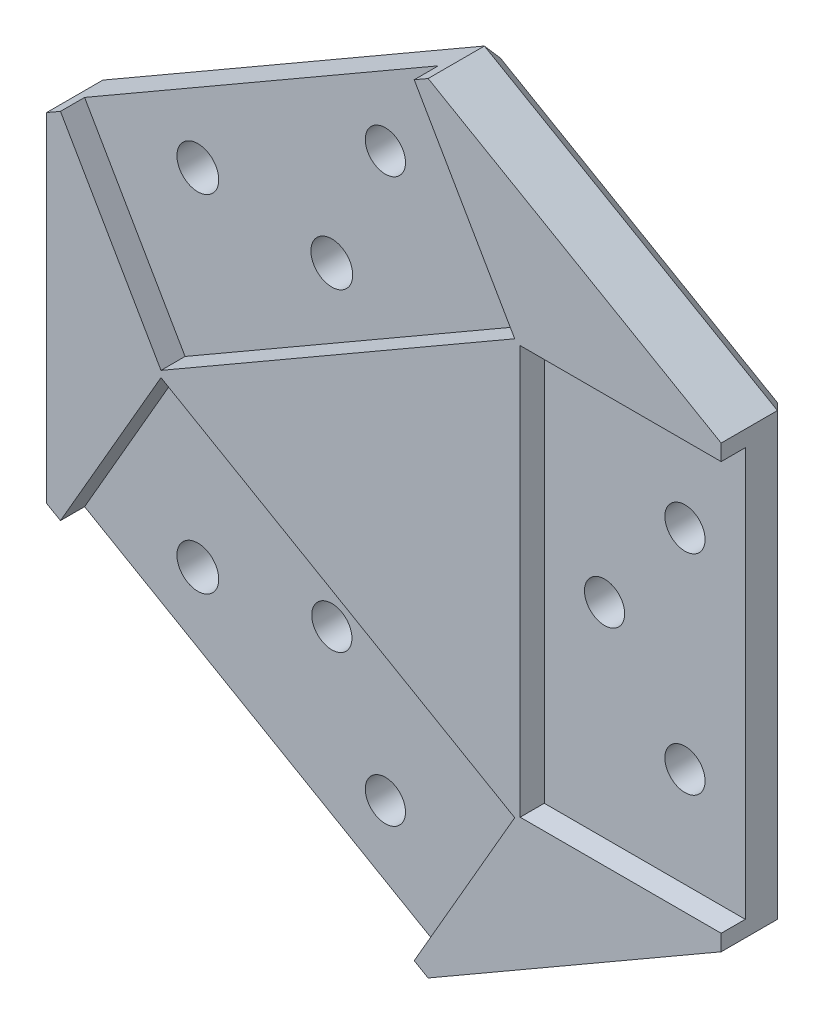
ISO-10303-21;
HEADER;
FILE_DESCRIPTION(('STEP AP214'),'2;1');
FILE_NAME('part.step','',(''),(''),'','','');
FILE_SCHEMA(('AUTOMOTIVE_DESIGN { 1 0 10303 214 1 1 1 1 }'));
ENDSEC;
DATA;
#1=APPLICATION_CONTEXT('core data for automotive mechanical design processes');
#2=APPLICATION_PROTOCOL_DEFINITION('international standard','automotive_design',2000,#1);
#3=PRODUCT_CONTEXT('',#1,'mechanical');
#4=PRODUCT('Part','Part','',(#3));
#5=PRODUCT_RELATED_PRODUCT_CATEGORY('part','',(#4));
#6=PRODUCT_DEFINITION_FORMATION('','',#4);
#7=PRODUCT_DEFINITION_CONTEXT('part definition',#1,'design');
#8=PRODUCT_DEFINITION('design','',#6,#7);
#9=PRODUCT_DEFINITION_SHAPE('','',#8);
#10=(LENGTH_UNIT() NAMED_UNIT(*) SI_UNIT(.MILLI.,.METRE.));
#11=(NAMED_UNIT(*) PLANE_ANGLE_UNIT() SI_UNIT($,.RADIAN.));
#12=(NAMED_UNIT(*) SI_UNIT($,.STERADIAN.) SOLID_ANGLE_UNIT());
#13=UNCERTAINTY_MEASURE_WITH_UNIT(LENGTH_MEASURE(1.E-05),#10,'distance_accuracy_value','');
#14=(GEOMETRIC_REPRESENTATION_CONTEXT(3) GLOBAL_UNCERTAINTY_ASSIGNED_CONTEXT((#13)) GLOBAL_UNIT_ASSIGNED_CONTEXT((#10,
#11,#12)) REPRESENTATION_CONTEXT('',''));
#15=CARTESIAN_POINT('',(0.,0.,0.));
#16=DIRECTION('',(0.,0.,1.));
#17=DIRECTION('',(1.,0.,0.));
#18=AXIS2_PLACEMENT_3D('',#15,#16,#17);
#19=CARTESIAN_POINT('',(2956.50955933893,1134.24136903722,6.));
#20=DIRECTION('',(0.,0.,1.));
#21=DIRECTION('',(1.,0.,0.));
#22=AXIS2_PLACEMENT_3D('',#19,#20,#21);
#23=PLANE('',#22);
#24=CARTESIAN_POINT('',(2953.69965040785,1269.05044132499,6.));
#25=DIRECTION('',(0.,0.,1.));
#26=DIRECTION('',(1.,0.,0.));
#27=AXIS2_PLACEMENT_3D('',#24,#25,#26);
#28=CIRCLE('',#27,2.49999999999995);
#29=CARTESIAN_POINT('',(2956.19965040785,1269.05044132499,6.));
#30=VERTEX_POINT('',#29);
#31=EDGE_CURVE('E473',#30,#30,#28,.T.);
#32=ORIENTED_EDGE('',*,*,#31,.F.);
#33=EDGE_LOOP('',(#32));
#34=FACE_BOUND('',#33,.T.);
#35=CARTESIAN_POINT('',(2930.37469953259,1255.58377465832,6.));
#36=DIRECTION('',(0.,0.,1.));
#37=DIRECTION('',(1.,0.,0.));
#38=AXIS2_PLACEMENT_3D('',#35,#36,#37);
#39=CIRCLE('',#38,2.60000000000016);
#40=CARTESIAN_POINT('',(2932.97469953259,1255.58377465832,6.));
#41=VERTEX_POINT('',#40);
#42=EDGE_CURVE('E476',#41,#41,#39,.T.);
#43=ORIENTED_EDGE('',*,*,#42,.F.);
#44=EDGE_LOOP('',(#43));
#45=FACE_BOUND('',#44,.T.);
#46=CARTESIAN_POINT('',(2947.03717497023,1253.65685395381,6.));
#47=DIRECTION('',(0.,0.,1.));
#48=DIRECTION('',(1.,0.,0.));
#49=AXIS2_PLACEMENT_3D('',#46,#47,#48);
#50=CIRCLE('',#49,2.60000000000016);
#51=CARTESIAN_POINT('',(2949.63717497023,1253.65685395381,6.));
#52=VERTEX_POINT('',#51);
#53=EDGE_CURVE('E479',#52,#52,#50,.T.);
#54=ORIENTED_EDGE('',*,*,#53,.F.);
#55=EDGE_LOOP('',(#54));
#56=FACE_BOUND('',#55,.T.);
#57=DIRECTION('',(0.866025403784455,0.499999999999972,0.));
#58=VECTOR('',#57,1.);
#59=CARTESIAN_POINT('',(2893.68304147526,1243.06009003974,6.));
#60=LINE('',#59,#58);
#61=CARTESIAN_POINT('',(2916.2901297141,1256.11229852003,6.));
#62=VERTEX_POINT('',#61);
#63=CARTESIAN_POINT('',(2960.28422022636,1281.51229852003,6.));
#64=VERTEX_POINT('',#63);
#65=EDGE_CURVE('E344',#62,#64,#60,.T.);
#66=ORIENTED_EDGE('',*,*,#65,.F.);
#67=DIRECTION('',(0.499999999999984,-0.866025403784448,0.));
#68=VECTOR('',#67,1.);
#69=CARTESIAN_POINT('',(2979.11664757778,1147.29357751751,6.));
#70=LINE('',#69,#68);
#71=CARTESIAN_POINT('',(2928.7901297141,1234.46166342542,6.));
#72=VERTEX_POINT('',#71);
#73=EDGE_CURVE('E383',#62,#72,#70,.T.);
#74=ORIENTED_EDGE('',*,*,#73,.T.);
#75=DIRECTION('',(0.866025403784332,0.500000000000184,0.));
#76=VECTOR('',#75,1.);
#77=CARTESIAN_POINT('',(2906.18304147524,1221.40945494511,6.));
#78=LINE('',#77,#76);
#79=CARTESIAN_POINT('',(2972.78422022635,1259.86166342543,6.));
#80=VERTEX_POINT('',#79);
#81=EDGE_CURVE('E376',#72,#80,#78,.T.);
#82=ORIENTED_EDGE('',*,*,#81,.T.);
#83=DIRECTION('',(0.499999999999986,-0.866025403784447,0.));
#84=VECTOR('',#83,1.);
#85=CARTESIAN_POINT('',(3023.11073809003,1172.69357751751,6.));
#86=LINE('',#85,#84);
#87=EDGE_CURVE('E361',#64,#80,#86,.T.);
#88=ORIENTED_EDGE('',*,*,#87,.F.);
#89=EDGE_LOOP('',(#66,#74,#82,#88));
#90=FACE_BOUND('',#89,.T.);
#91=ADVANCED_FACE('F35',(#34,#45,#56,#90),#23,.T.);
#92=CARTESIAN_POINT('',(2990.96103977133,1221.07090147894,6.));
#93=DIRECTION('',(0.,0.,1.));
#94=DIRECTION('',(1.,0.,0.));
#95=AXIS2_PLACEMENT_3D('',#92,#93,#94);
#96=CIRCLE('',#95,2.49999999999995);
#97=CARTESIAN_POINT('',(2993.46103977133,1221.07090147894,6.));
#98=VERTEX_POINT('',#97);
#99=EDGE_CURVE('E438',#98,#98,#96,.T.);
#100=ORIENTED_EDGE('',*,*,#99,.F.);
#101=EDGE_LOOP('',(#100));
#102=FACE_BOUND('',#101,.T.);
#103=CARTESIAN_POINT('',(2980.96103977133,1234.07090147894,6.));
#104=DIRECTION('',(0.,0.,1.));
#105=DIRECTION('',(1.,0.,0.));
#106=AXIS2_PLACEMENT_3D('',#103,#104,#105);
#107=CIRCLE('',#106,2.49999999999995);
#108=CARTESIAN_POINT('',(2983.46103977133,1234.07090147894,6.));
#109=VERTEX_POINT('',#108);
#110=EDGE_CURVE('E440',#109,#109,#107,.T.);
#111=ORIENTED_EDGE('',*,*,#110,.F.);
#112=EDGE_LOOP('',(#111));
#113=FACE_BOUND('',#112,.T.);
#114=CARTESIAN_POINT('',(2990.96103977133,1247.07090147894,6.));
#115=DIRECTION('',(0.,0.,1.));
#116=DIRECTION('',(1.,0.,0.));
#117=AXIS2_PLACEMENT_3D('',#114,#115,#116);
#118=CIRCLE('',#117,2.49999999999995);
#119=CARTESIAN_POINT('',(2993.46103977133,1247.07090147894,6.));
#120=VERTEX_POINT('',#119);
#121=EDGE_CURVE('E470',#120,#120,#118,.T.);
#122=ORIENTED_EDGE('',*,*,#121,.F.);
#123=EDGE_LOOP('',(#122));
#124=FACE_BOUND('',#123,.T.);
#125=DIRECTION('',(-1.48612530855335E-13,-1.,0.));
#126=VECTOR('',#125,1.);
#127=CARTESIAN_POINT('',(2973.46103977131,1134.24136903722,6.));
#128=LINE('',#127,#126);
#129=CARTESIAN_POINT('',(2973.46103977133,1259.47090147894,6.));
#130=VERTEX_POINT('',#129);
#131=CARTESIAN_POINT('',(2973.46103977132,1208.67090147894,6.));
#132=VERTEX_POINT('',#131);
#133=EDGE_CURVE('E242',#130,#132,#128,.T.);
#134=ORIENTED_EDGE('',*,*,#133,.T.);
#135=DIRECTION('',(1.,0.,0.));
#136=VECTOR('',#135,1.);
#137=CARTESIAN_POINT('',(2956.50955933893,1208.67090147894,6.));
#138=LINE('',#137,#136);
#139=CARTESIAN_POINT('',(2998.46103977133,1208.67090147894,6.));
#140=VERTEX_POINT('',#139);
#141=EDGE_CURVE('E184',#132,#140,#138,.T.);
#142=ORIENTED_EDGE('',*,*,#141,.T.);
#143=DIRECTION('',(0.,-1.,0.));
#144=VECTOR('',#143,1.);
#145=CARTESIAN_POINT('',(2998.46103977133,1134.24136903722,6.));
#146=LINE('',#145,#144);
#147=CARTESIAN_POINT('',(2998.46103977133,1259.47090147894,6.));
#148=VERTEX_POINT('',#147);
#149=EDGE_CURVE('E340',#148,#140,#146,.T.);
#150=ORIENTED_EDGE('',*,*,#149,.F.);
#151=DIRECTION('',(1.,1.15463194561027E-13,0.));
#152=VECTOR('',#151,1.);
#153=CARTESIAN_POINT('',(2956.50955933891,1259.47090147894,6.));
#154=LINE('',#153,#152);
#155=EDGE_CURVE('E359',#130,#148,#154,.T.);
#156=ORIENTED_EDGE('',*,*,#155,.F.);
#157=EDGE_LOOP('',(#134,#142,#150,#156));
#158=FACE_BOUND('',#157,.T.);
#159=ADVANCED_FACE('F406',(#102,#113,#124,#158),#23,.T.);
#160=CARTESIAN_POINT('',(2998.46103977133,1134.24136903722,6.));
#161=DIRECTION('',(1.,0.,0.));
#162=DIRECTION('',(0.,1.,0.));
#163=AXIS2_PLACEMENT_3D('',#160,#161,#162);
#164=PLANE('',#163);
#165=DIRECTION('',(0.,0.,-1.));
#166=VECTOR('',#165,1.);
#167=CARTESIAN_POINT('',(2998.46103977133,1206.67090147895,6.));
#168=LINE('',#167,#166);
#169=CARTESIAN_POINT('',(2998.46103977133,1206.67090147895,9.));
#170=VERTEX_POINT('',#169);
#171=CARTESIAN_POINT('',(2998.46103977133,1206.67090147895,2.00000000000006));
#172=VERTEX_POINT('',#171);
#173=EDGE_CURVE('E335',#170,#172,#168,.T.);
#174=ORIENTED_EDGE('',*,*,#173,.T.);
#175=DIRECTION('',(0.,1.,0.));
#176=VECTOR('',#175,1.);
#177=CARTESIAN_POINT('',(2998.46103977133,1261.47090147895,2.00000000000006));
#178=LINE('',#177,#176);
#179=CARTESIAN_POINT('',(2998.46103977133,1261.47090147895,2.00000000000006));
#180=VERTEX_POINT('',#179);
#181=EDGE_CURVE('E44',#172,#180,#178,.T.);
#182=ORIENTED_EDGE('',*,*,#181,.T.);
#183=DIRECTION('',(0.,0.,-1.));
#184=VECTOR('',#183,1.);
#185=CARTESIAN_POINT('',(2998.46103977133,1261.47090147895,6.));
#186=LINE('',#185,#184);
#187=CARTESIAN_POINT('',(2998.46103977133,1261.47090147895,9.));
#188=VERTEX_POINT('',#187);
#189=EDGE_CURVE('E252',#188,#180,#186,.T.);
#190=ORIENTED_EDGE('',*,*,#189,.F.);
#191=DIRECTION('',(0.,1.,0.));
#192=VECTOR('',#191,1.);
#193=CARTESIAN_POINT('',(2998.46103977133,1134.24136903722,9.));
#194=LINE('',#193,#192);
#195=CARTESIAN_POINT('',(2998.46103977133,1259.47090147894,9.));
#196=VERTEX_POINT('',#195);
#197=EDGE_CURVE('E206',#196,#188,#194,.T.);
#198=ORIENTED_EDGE('',*,*,#197,.F.);
#199=DIRECTION('',(0.,0.,-1.));
#200=VECTOR('',#199,1.);
#201=CARTESIAN_POINT('',(2998.46103977133,1259.47090147894,9.));
#202=LINE('',#201,#200);
#203=EDGE_CURVE('E364',#196,#148,#202,.T.);
#204=ORIENTED_EDGE('',*,*,#203,.T.);
#205=ORIENTED_EDGE('',*,*,#149,.T.);
#206=DIRECTION('',(0.,0.,-1.));
#207=VECTOR('',#206,1.);
#208=CARTESIAN_POINT('',(2998.46103977133,1208.67090147894,9.));
#209=LINE('',#208,#207);
#210=CARTESIAN_POINT('',(2998.46103977133,1208.67090147894,9.));
#211=VERTEX_POINT('',#210);
#212=EDGE_CURVE('E402',#211,#140,#209,.T.);
#213=ORIENTED_EDGE('',*,*,#212,.F.);
#214=EDGE_CURVE('E198',#170,#211,#194,.T.);
#215=ORIENTED_EDGE('',*,*,#214,.F.);
#216=EDGE_LOOP('',(#174,#182,#190,#198,#204,#205,#213,#215));
#217=FACE_BOUND('',#216,.T.);
#218=ADVANCED_FACE('F408',(#217),#164,.T.);
#219=CARTESIAN_POINT('',(3022.08943305008,1247.82904225895,6.));
#220=DIRECTION('',(0.499999999999793,0.866025403784558,0.));
#221=DIRECTION('',(-0.866025403784558,0.499999999999794,0.));
#222=AXIS2_PLACEMENT_3D('',#219,#220,#221);
#223=PLANE('',#222);
#224=ORIENTED_EDGE('',*,*,#189,.T.);
#225=DIRECTION('',(-0.866025403784558,0.499999999999794,0.));
#226=VECTOR('',#225,1.);
#227=CARTESIAN_POINT('',(2962.01627103393,1282.51229852003,2.00000000000005));
#228=LINE('',#227,#226);
#229=CARTESIAN_POINT('',(2962.01627103393,1282.51229852003,2.00000000000006));
#230=VERTEX_POINT('',#229);
#231=EDGE_CURVE('E11',#180,#230,#228,.T.);
#232=ORIENTED_EDGE('',*,*,#231,.T.);
#233=DIRECTION('',(0.,0.,-1.));
#234=VECTOR('',#233,1.);
#235=CARTESIAN_POINT('',(2962.01627103393,1282.51229852003,6.));
#236=LINE('',#235,#234);
#237=CARTESIAN_POINT('',(2962.01627103393,1282.51229852003,9.));
#238=VERTEX_POINT('',#237);
#239=EDGE_CURVE('E306',#238,#230,#236,.T.);
#240=ORIENTED_EDGE('',*,*,#239,.F.);
#241=DIRECTION('',(-0.866025403784558,0.499999999999794,0.));
#242=VECTOR('',#241,1.);
#243=CARTESIAN_POINT('',(3022.08943305008,1247.82904225895,9.));
#244=LINE('',#243,#242);
#245=EDGE_CURVE('E211',#188,#238,#244,.T.);
#246=ORIENTED_EDGE('',*,*,#245,.F.);
#247=EDGE_LOOP('',(#224,#232,#240,#246));
#248=FACE_BOUND('',#247,.T.);
#249=ADVANCED_FACE('F304',(#248),#223,.T.);
#250=CARTESIAN_POINT('',(2893.68304147526,1243.06009003974,6.));
#251=DIRECTION('',(-0.499999999999972,0.866025403784455,0.));
#252=DIRECTION('',(-0.866025403784455,-0.499999999999972,0.));
#253=AXIS2_PLACEMENT_3D('',#250,#251,#252);
#254=PLANE('',#253);
#255=ORIENTED_EDGE('',*,*,#239,.T.);
#256=DIRECTION('',(-0.866025403784455,-0.499999999999972,0.));
#257=VECTOR('',#256,1.);
#258=CARTESIAN_POINT('',(2914.55807890654,1255.11229852003,2.00000000000006));
#259=LINE('',#258,#257);
#260=CARTESIAN_POINT('',(2914.55807890654,1255.11229852003,2.00000000000006));
#261=VERTEX_POINT('',#260);
#262=EDGE_CURVE('E263',#230,#261,#259,.T.);
#263=ORIENTED_EDGE('',*,*,#262,.T.);
#264=DIRECTION('',(0.,0.,-1.));
#265=VECTOR('',#264,1.);
#266=CARTESIAN_POINT('',(2914.55807890654,1255.11229852003,6.));
#267=LINE('',#266,#265);
#268=CARTESIAN_POINT('',(2914.55807890654,1255.11229852003,9.));
#269=VERTEX_POINT('',#268);
#270=EDGE_CURVE('E313',#269,#261,#267,.T.);
#271=ORIENTED_EDGE('',*,*,#270,.F.);
#272=DIRECTION('',(-0.866025403784455,-0.499999999999972,0.));
#273=VECTOR('',#272,1.);
#274=CARTESIAN_POINT('',(2893.68304147526,1243.06009003974,9.));
#275=LINE('',#274,#273);
#276=CARTESIAN_POINT('',(2916.2901297141,1256.11229852003,9.));
#277=VERTEX_POINT('',#276);
#278=EDGE_CURVE('E217',#277,#269,#275,.T.);
#279=ORIENTED_EDGE('',*,*,#278,.F.);
#280=DIRECTION('',(0.,0.,-1.));
#281=VECTOR('',#280,1.);
#282=CARTESIAN_POINT('',(2916.2901297141,1256.11229852003,9.));
#283=LINE('',#282,#281);
#284=EDGE_CURVE('E377',#277,#62,#283,.T.);
#285=ORIENTED_EDGE('',*,*,#284,.T.);
#286=ORIENTED_EDGE('',*,*,#65,.T.);
#287=DIRECTION('',(0.,0.,-1.));
#288=VECTOR('',#287,1.);
#289=CARTESIAN_POINT('',(2960.28422022636,1281.51229852003,9.));
#290=LINE('',#289,#288);
#291=CARTESIAN_POINT('',(2960.28422022636,1281.51229852003,9.));
#292=VERTEX_POINT('',#291);
#293=EDGE_CURVE('E367',#292,#64,#290,.T.);
#294=ORIENTED_EDGE('',*,*,#293,.F.);
#295=EDGE_CURVE('E214',#238,#292,#275,.T.);
#296=ORIENTED_EDGE('',*,*,#295,.F.);
#297=EDGE_LOOP('',(#255,#263,#271,#279,#285,#286,#294,#296));
#298=FACE_BOUND('',#297,.T.);
#299=ADVANCED_FACE('F310',(#298),#254,.T.);
#300=CARTESIAN_POINT('',(2914.5580789065,1134.24136903723,6.));
#301=DIRECTION('',(1.,-2.63818752732291E-13,0.));
#302=DIRECTION('',(2.63818752732291E-13,1.,0.));
#303=AXIS2_PLACEMENT_3D('',#300,#301,#302);
#304=PLANE('',#303);
#305=ORIENTED_EDGE('',*,*,#270,.T.);
#306=DIRECTION('',(-2.63818752732291E-13,-1.,0.));
#307=VECTOR('',#306,1.);
#308=CARTESIAN_POINT('',(2914.5580789065,1134.24136903723,2.00000000000006));
#309=LINE('',#308,#307);
#310=CARTESIAN_POINT('',(2914.55807890653,1213.02950443785,2.00000000000006));
#311=VERTEX_POINT('',#310);
#312=EDGE_CURVE('E266',#261,#311,#309,.T.);
#313=ORIENTED_EDGE('',*,*,#312,.T.);
#314=DIRECTION('',(0.,0.,-1.));
#315=VECTOR('',#314,1.);
#316=CARTESIAN_POINT('',(2914.55807890653,1213.02950443785,6.));
#317=LINE('',#316,#315);
#318=CARTESIAN_POINT('',(2914.55807890653,1213.02950443785,9.));
#319=VERTEX_POINT('',#318);
#320=EDGE_CURVE('E327',#319,#311,#317,.T.);
#321=ORIENTED_EDGE('',*,*,#320,.F.);
#322=DIRECTION('',(-2.63818752732291E-13,-1.,0.));
#323=VECTOR('',#322,1.);
#324=CARTESIAN_POINT('',(2914.5580789065,1134.24136903723,9.));
#325=LINE('',#324,#323);
#326=EDGE_CURVE('E225',#269,#319,#325,.T.);
#327=ORIENTED_EDGE('',*,*,#326,.F.);
#328=EDGE_LOOP('',(#305,#313,#321,#327));
#329=FACE_BOUND('',#328,.T.);
#330=ADVANCED_FACE('F325',(#329),#304,.F.);
#331=CARTESIAN_POINT('',(2980.13795261771,1175.16694669724,6.));
#332=DIRECTION('',(0.500000000000381,0.866025403784218,0.));
#333=DIRECTION('',(-0.866025403784219,0.500000000000381,0.));
#334=AXIS2_PLACEMENT_3D('',#331,#332,#333);
#335=PLANE('',#334);
#336=ORIENTED_EDGE('',*,*,#320,.T.);
#337=DIRECTION('',(0.866025403784219,-0.500000000000381,0.));
#338=VECTOR('',#337,1.);
#339=CARTESIAN_POINT('',(2980.13795261771,1175.16694669724,2.00000000000005));
#340=LINE('',#339,#338);
#341=CARTESIAN_POINT('',(2962.01627103391,1185.62950443782,2.00000000000006));
#342=VERTEX_POINT('',#341);
#343=EDGE_CURVE('E268',#311,#342,#340,.T.);
#344=ORIENTED_EDGE('',*,*,#343,.T.);
#345=DIRECTION('',(0.,0.,-1.));
#346=VECTOR('',#345,1.);
#347=CARTESIAN_POINT('',(2962.01627103391,1185.62950443782,6.));
#348=LINE('',#347,#346);
#349=CARTESIAN_POINT('',(2962.01627103391,1185.62950443782,9.));
#350=VERTEX_POINT('',#349);
#351=EDGE_CURVE('E332',#350,#342,#348,.T.);
#352=ORIENTED_EDGE('',*,*,#351,.F.);
#353=DIRECTION('',(0.866025403784219,-0.500000000000381,0.));
#354=VECTOR('',#353,1.);
#355=CARTESIAN_POINT('',(2980.13795261771,1175.16694669724,9.));
#356=LINE('',#355,#354);
#357=CARTESIAN_POINT('',(2960.28422022633,1186.62950443783,9.));
#358=VERTEX_POINT('',#357);
#359=EDGE_CURVE('E231',#358,#350,#356,.T.);
#360=ORIENTED_EDGE('',*,*,#359,.F.);
#361=DIRECTION('',(0.,0.,-1.));
#362=VECTOR('',#361,1.);
#363=CARTESIAN_POINT('',(2960.28422022633,1186.62950443783,9.));
#364=LINE('',#363,#362);
#365=CARTESIAN_POINT('',(2960.28422022633,1186.62950443783,6.));
#366=VERTEX_POINT('',#365);
#367=EDGE_CURVE('E398',#358,#366,#364,.T.);
#368=ORIENTED_EDGE('',*,*,#367,.T.);
#369=DIRECTION('',(0.866025403784219,-0.500000000000381,0.));
#370=VECTOR('',#369,1.);
#371=CARTESIAN_POINT('',(2980.13795261771,1175.16694669724,6.));
#372=LINE('',#371,#370);
#373=CARTESIAN_POINT('',(2916.29012971409,1212.02950443785,6.));
#374=VERTEX_POINT('',#373);
#375=EDGE_CURVE('E356',#374,#366,#372,.T.);
#376=ORIENTED_EDGE('',*,*,#375,.F.);
#377=DIRECTION('',(0.,0.,-1.));
#378=VECTOR('',#377,1.);
#379=CARTESIAN_POINT('',(2916.29012971409,1212.02950443785,9.));
#380=LINE('',#379,#378);
#381=CARTESIAN_POINT('',(2916.29012971409,1212.02950443785,9.));
#382=VERTEX_POINT('',#381);
#383=EDGE_CURVE('E418',#382,#374,#380,.T.);
#384=ORIENTED_EDGE('',*,*,#383,.F.);
#385=EDGE_CURVE('E228',#319,#382,#356,.T.);
#386=ORIENTED_EDGE('',*,*,#385,.F.);
#387=EDGE_LOOP('',(#336,#344,#352,#360,#368,#376,#384,#386));
#388=FACE_BOUND('',#387,.T.);
#389=ADVANCED_FACE('F330',(#388),#335,.F.);
#390=CARTESIAN_POINT('',(2980.96103977133,1234.07090147894,6.));
#391=DIRECTION('',(0.,0.,-1.));
#392=DIRECTION('',(-1.,0.,0.));
#393=AXIS2_PLACEMENT_3D('',#390,#391,#392);
#394=CYLINDRICAL_SURFACE('',#393,2.49999999999995);
#395=ORIENTED_EDGE('',*,*,#110,.T.);
#396=EDGE_LOOP('',(#395));
#397=FACE_BOUND('',#396,.T.);
#398=CARTESIAN_POINT('',(2980.96103977133,1234.07090147894,0.));
#399=DIRECTION('',(0.,0.,1.));
#400=DIRECTION('',(1.,0.,0.));
#401=AXIS2_PLACEMENT_3D('',#398,#399,#400);
#402=CIRCLE('',#401,2.49999999999995);
#403=CARTESIAN_POINT('',(2983.46103977133,1234.07090147894,0.));
#404=VERTEX_POINT('',#403);
#405=EDGE_CURVE('E445',#404,#404,#402,.T.);
#406=ORIENTED_EDGE('',*,*,#405,.F.);
#407=EDGE_LOOP('',(#406));
#408=FACE_BOUND('',#407,.T.);
#409=ADVANCED_FACE('F596',(#397,#408),#394,.F.);
#410=CARTESIAN_POINT('',(2990.96103977133,1247.07090147894,6.));
#411=DIRECTION('',(0.,0.,-1.));
#412=DIRECTION('',(-1.,0.,0.));
#413=AXIS2_PLACEMENT_3D('',#410,#411,#412);
#414=CYLINDRICAL_SURFACE('',#413,2.49999999999995);
#415=ORIENTED_EDGE('',*,*,#121,.T.);
#416=EDGE_LOOP('',(#415));
#417=FACE_BOUND('',#416,.T.);
#418=CARTESIAN_POINT('',(2990.96103977133,1247.07090147894,0.));
#419=DIRECTION('',(0.,0.,1.));
#420=DIRECTION('',(1.,0.,0.));
#421=AXIS2_PLACEMENT_3D('',#418,#419,#420);
#422=CIRCLE('',#421,2.49999999999995);
#423=CARTESIAN_POINT('',(2993.46103977133,1247.07090147894,0.));
#424=VERTEX_POINT('',#423);
#425=EDGE_CURVE('E448',#424,#424,#422,.T.);
#426=ORIENTED_EDGE('',*,*,#425,.F.);
#427=EDGE_LOOP('',(#426));
#428=FACE_BOUND('',#427,.T.);
#429=ADVANCED_FACE('F612',(#417,#428),#414,.F.);
#430=CARTESIAN_POINT('',(2953.69965040785,1269.05044132499,6.));
#431=DIRECTION('',(0.,0.,-1.));
#432=DIRECTION('',(-1.,0.,0.));
#433=AXIS2_PLACEMENT_3D('',#430,#431,#432);
#434=CYLINDRICAL_SURFACE('',#433,2.49999999999995);
#435=ORIENTED_EDGE('',*,*,#31,.T.);
#436=EDGE_LOOP('',(#435));
#437=FACE_BOUND('',#436,.T.);
#438=CARTESIAN_POINT('',(2953.69965040785,1269.05044132499,0.));
#439=DIRECTION('',(0.,0.,1.));
#440=DIRECTION('',(1.,0.,0.));
#441=AXIS2_PLACEMENT_3D('',#438,#439,#440);
#442=CIRCLE('',#441,2.49999999999995);
#443=CARTESIAN_POINT('',(2956.19965040785,1269.05044132499,0.));
#444=VERTEX_POINT('',#443);
#445=EDGE_CURVE('E451',#444,#444,#442,.T.);
#446=ORIENTED_EDGE('',*,*,#445,.F.);
#447=EDGE_LOOP('',(#446));
#448=FACE_BOUND('',#447,.T.);
#449=ADVANCED_FACE('F608',(#437,#448),#434,.F.);
#450=CARTESIAN_POINT('',(2930.37469953259,1255.58377465832,6.));
#451=DIRECTION('',(0.,0.,-1.));
#452=DIRECTION('',(-1.,0.,0.));
#453=AXIS2_PLACEMENT_3D('',#450,#451,#452);
#454=CYLINDRICAL_SURFACE('',#453,2.60000000000016);
#455=ORIENTED_EDGE('',*,*,#42,.T.);
#456=EDGE_LOOP('',(#455));
#457=FACE_BOUND('',#456,.T.);
#458=CARTESIAN_POINT('',(2930.37469953259,1255.58377465832,0.));
#459=DIRECTION('',(0.,0.,1.));
#460=DIRECTION('',(1.,0.,0.));
#461=AXIS2_PLACEMENT_3D('',#458,#459,#460);
#462=CIRCLE('',#461,2.60000000000016);
#463=CARTESIAN_POINT('',(2932.97469953259,1255.58377465832,0.));
#464=VERTEX_POINT('',#463);
#465=EDGE_CURVE('E454',#464,#464,#462,.T.);
#466=ORIENTED_EDGE('',*,*,#465,.F.);
#467=EDGE_LOOP('',(#466));
#468=FACE_BOUND('',#467,.T.);
#469=ADVANCED_FACE('F604',(#457,#468),#454,.F.);
#470=CARTESIAN_POINT('',(2947.03717497023,1253.65685395381,6.));
#471=DIRECTION('',(0.,0.,-1.));
#472=DIRECTION('',(-1.,0.,0.));
#473=AXIS2_PLACEMENT_3D('',#470,#471,#472);
#474=CYLINDRICAL_SURFACE('',#473,2.60000000000016);
#475=ORIENTED_EDGE('',*,*,#53,.T.);
#476=EDGE_LOOP('',(#475));
#477=FACE_BOUND('',#476,.T.);
#478=CARTESIAN_POINT('',(2947.03717497023,1253.65685395381,0.));
#479=DIRECTION('',(0.,0.,1.));
#480=DIRECTION('',(1.,0.,0.));
#481=AXIS2_PLACEMENT_3D('',#478,#479,#480);
#482=CIRCLE('',#481,2.60000000000016);
#483=CARTESIAN_POINT('',(2949.63717497023,1253.65685395381,0.));
#484=VERTEX_POINT('',#483);
#485=EDGE_CURVE('E457',#484,#484,#482,.T.);
#486=ORIENTED_EDGE('',*,*,#485,.F.);
#487=EDGE_LOOP('',(#486));
#488=FACE_BOUND('',#487,.T.);
#489=ADVANCED_FACE('F505',(#477,#488),#474,.F.);
#490=CARTESIAN_POINT('',(2947.03717497022,1214.48494900406,6.));
#491=DIRECTION('',(0.,0.,-1.));
#492=DIRECTION('',(-1.,0.,0.));
#493=AXIS2_PLACEMENT_3D('',#490,#491,#492);
#494=CYLINDRICAL_SURFACE('',#493,2.49999999999995);
#495=CARTESIAN_POINT('',(2947.03717497022,1214.48494900406,6.));
#496=DIRECTION('',(0.,0.,1.));
#497=DIRECTION('',(1.,0.,0.));
#498=AXIS2_PLACEMENT_3D('',#495,#496,#497);
#499=CIRCLE('',#498,2.49999999999995);
#500=CARTESIAN_POINT('',(2949.53717497022,1214.48494900406,6.));
#501=VERTEX_POINT('',#500);
#502=EDGE_CURVE('E482',#501,#501,#499,.T.);
#503=ORIENTED_EDGE('',*,*,#502,.T.);
#504=EDGE_LOOP('',(#503));
#505=FACE_BOUND('',#504,.T.);
#506=CARTESIAN_POINT('',(2947.03717497022,1214.48494900406,0.));
#507=DIRECTION('',(0.,0.,1.));
#508=DIRECTION('',(1.,0.,0.));
#509=AXIS2_PLACEMENT_3D('',#506,#507,#508);
#510=CIRCLE('',#509,2.49999999999995);
#511=CARTESIAN_POINT('',(2949.53717497022,1214.48494900406,0.));
#512=VERTEX_POINT('',#511);
#513=EDGE_CURVE('E460',#512,#512,#510,.T.);
#514=ORIENTED_EDGE('',*,*,#513,.F.);
#515=EDGE_LOOP('',(#514));
#516=FACE_BOUND('',#515,.T.);
#517=ADVANCED_FACE('F501',(#505,#516),#494,.F.);
#518=CARTESIAN_POINT('',(2953.69965040785,1199.09136163288,6.));
#519=DIRECTION('',(0.,0.,-1.));
#520=DIRECTION('',(-1.,0.,0.));
#521=AXIS2_PLACEMENT_3D('',#518,#519,#520);
#522=CYLINDRICAL_SURFACE('',#521,2.49999999999995);
#523=CARTESIAN_POINT('',(2953.69965040785,1199.09136163288,6.));
#524=DIRECTION('',(0.,0.,1.));
#525=DIRECTION('',(1.,0.,0.));
#526=AXIS2_PLACEMENT_3D('',#523,#524,#525);
#527=CIRCLE('',#526,2.49999999999995);
#528=CARTESIAN_POINT('',(2956.19965040785,1199.09136163288,6.));
#529=VERTEX_POINT('',#528);
#530=EDGE_CURVE('E484',#529,#529,#527,.T.);
#531=ORIENTED_EDGE('',*,*,#530,.T.);
#532=EDGE_LOOP('',(#531));
#533=FACE_BOUND('',#532,.T.);
#534=CARTESIAN_POINT('',(2953.69965040785,1199.09136163288,0.));
#535=DIRECTION('',(0.,0.,1.));
#536=DIRECTION('',(1.,0.,0.));
#537=AXIS2_PLACEMENT_3D('',#534,#535,#536);
#538=CIRCLE('',#537,2.49999999999995);
#539=CARTESIAN_POINT('',(2956.19965040785,1199.09136163288,0.));
#540=VERTEX_POINT('',#539);
#541=EDGE_CURVE('E463',#540,#540,#538,.T.);
#542=ORIENTED_EDGE('',*,*,#541,.F.);
#543=EDGE_LOOP('',(#542));
#544=FACE_BOUND('',#543,.T.);
#545=ADVANCED_FACE('F504',(#533,#544),#522,.F.);
#546=CARTESIAN_POINT('',(2930.37469953259,1212.55802829956,6.));
#547=DIRECTION('',(0.,0.,-1.));
#548=DIRECTION('',(-1.,0.,0.));
#549=AXIS2_PLACEMENT_3D('',#546,#547,#548);
#550=CYLINDRICAL_SURFACE('',#549,2.60000000000016);
#551=CARTESIAN_POINT('',(2930.37469953259,1212.55802829956,6.));
#552=DIRECTION('',(0.,0.,1.));
#553=DIRECTION('',(1.,0.,0.));
#554=AXIS2_PLACEMENT_3D('',#551,#552,#553);
#555=CIRCLE('',#554,2.60000000000016);
#556=CARTESIAN_POINT('',(2932.97469953259,1212.55802829956,6.));
#557=VERTEX_POINT('',#556);
#558=EDGE_CURVE('E354',#557,#557,#555,.T.);
#559=ORIENTED_EDGE('',*,*,#558,.T.);
#560=EDGE_LOOP('',(#559));
#561=FACE_BOUND('',#560,.T.);
#562=CARTESIAN_POINT('',(2930.37469953259,1212.55802829956,0.));
#563=DIRECTION('',(0.,0.,1.));
#564=DIRECTION('',(1.,0.,0.));
#565=AXIS2_PLACEMENT_3D('',#562,#563,#564);
#566=CIRCLE('',#565,2.60000000000016);
#567=CARTESIAN_POINT('',(2932.97469953259,1212.55802829956,0.));
#568=VERTEX_POINT('',#567);
#569=EDGE_CURVE('E189',#568,#568,#566,.T.);
#570=ORIENTED_EDGE('',*,*,#569,.F.);
#571=EDGE_LOOP('',(#570));
#572=FACE_BOUND('',#571,.T.);
#573=ADVANCED_FACE('F491',(#561,#572),#550,.F.);
#574=CARTESIAN_POINT('',(2935.63452190765,1170.39799447807,6.));
#575=DIRECTION('',(-0.500000000000307,0.866025403784262,0.));
#576=DIRECTION('',(-0.866025403784262,-0.500000000000307,0.));
#577=AXIS2_PLACEMENT_3D('',#574,#575,#576);
#578=PLANE('',#577);
#579=ORIENTED_EDGE('',*,*,#351,.T.);
#580=DIRECTION('',(0.866025403784262,0.500000000000307,0.));
#581=VECTOR('',#580,1.);
#582=CARTESIAN_POINT('',(2935.63452190765,1170.39799447807,2.00000000000006));
#583=LINE('',#582,#581);
#584=EDGE_CURVE('E59',#342,#172,#583,.T.);
#585=ORIENTED_EDGE('',*,*,#584,.T.);
#586=ORIENTED_EDGE('',*,*,#173,.F.);
#587=DIRECTION('',(0.866025403784262,0.500000000000307,0.));
#588=VECTOR('',#587,1.);
#589=CARTESIAN_POINT('',(2935.63452190765,1170.39799447807,9.));
#590=LINE('',#589,#588);
#591=EDGE_CURVE('E238',#350,#170,#590,.T.);
#592=ORIENTED_EDGE('',*,*,#591,.F.);
#593=EDGE_LOOP('',(#579,#585,#586,#592));
#594=FACE_BOUND('',#593,.T.);
#595=ADVANCED_FACE('F437',(#594),#578,.F.);
#596=CARTESIAN_POINT('',(2990.96103977133,1221.07090147894,6.));
#597=DIRECTION('',(0.,0.,-1.));
#598=DIRECTION('',(-1.,0.,0.));
#599=AXIS2_PLACEMENT_3D('',#596,#597,#598);
#600=CYLINDRICAL_SURFACE('',#599,2.49999999999995);
#601=ORIENTED_EDGE('',*,*,#99,.T.);
#602=EDGE_LOOP('',(#601));
#603=FACE_BOUND('',#602,.T.);
#604=CARTESIAN_POINT('',(2990.96103977133,1221.07090147894,0.));
#605=DIRECTION('',(0.,0.,1.));
#606=DIRECTION('',(1.,0.,0.));
#607=AXIS2_PLACEMENT_3D('',#604,#605,#606);
#608=CIRCLE('',#607,2.49999999999995);
#609=CARTESIAN_POINT('',(2993.46103977133,1221.07090147894,0.));
#610=VERTEX_POINT('',#609);
#611=EDGE_CURVE('E345',#610,#610,#608,.T.);
#612=ORIENTED_EDGE('',*,*,#611,.F.);
#613=EDGE_LOOP('',(#612));
#614=FACE_BOUND('',#613,.T.);
#615=ADVANCED_FACE('F496',(#603,#614),#600,.F.);
#616=DIRECTION('',(-0.50000000000038,-0.86602540378422,0.));
#617=VECTOR('',#616,1.);
#618=CARTESIAN_POINT('',(2936.65582694755,1145.70392677781,6.));
#619=LINE('',#618,#617);
#620=CARTESIAN_POINT('',(2972.78422022634,1208.28013953243,6.));
#621=VERTEX_POINT('',#620);
#622=EDGE_CURVE('E200',#621,#366,#619,.T.);
#623=ORIENTED_EDGE('',*,*,#622,.F.);
#624=DIRECTION('',(0.86602540378422,-0.50000000000038,0.));
#625=VECTOR('',#624,1.);
#626=CARTESIAN_POINT('',(2992.63795261772,1196.81758179184,6.));
#627=LINE('',#626,#625);
#628=CARTESIAN_POINT('',(2928.7901297141,1233.68013953246,6.));
#629=VERTEX_POINT('',#628);
#630=EDGE_CURVE('E386',#629,#621,#627,.T.);
#631=ORIENTED_EDGE('',*,*,#630,.F.);
#632=DIRECTION('',(-0.50000000000038,-0.86602540378422,0.));
#633=VECTOR('',#632,1.);
#634=CARTESIAN_POINT('',(2892.66173643531,1171.10392677783,6.));
#635=LINE('',#634,#633);
#636=EDGE_CURVE('E389',#629,#374,#635,.T.);
#637=ORIENTED_EDGE('',*,*,#636,.T.);
#638=ORIENTED_EDGE('',*,*,#375,.T.);
#639=EDGE_LOOP('',(#623,#631,#637,#638));
#640=FACE_BOUND('',#639,.T.);
#641=ORIENTED_EDGE('',*,*,#558,.F.);
#642=EDGE_LOOP('',(#641));
#643=FACE_BOUND('',#642,.T.);
#644=ORIENTED_EDGE('',*,*,#530,.F.);
#645=EDGE_LOOP('',(#644));
#646=FACE_BOUND('',#645,.T.);
#647=ORIENTED_EDGE('',*,*,#502,.F.);
#648=EDGE_LOOP('',(#647));
#649=FACE_BOUND('',#648,.T.);
#650=ADVANCED_FACE('F430',(#640,#643,#646,#649),#23,.T.);
#651=CARTESIAN_POINT('',(2956.50955933893,1134.24136903722,0.));
#652=DIRECTION('',(0.,0.,1.));
#653=DIRECTION('',(1.,0.,0.));
#654=AXIS2_PLACEMENT_3D('',#651,#652,#653);
#655=PLANE('',#654);
#656=DIRECTION('',(2.63818752732291E-13,1.,0.));
#657=VECTOR('',#656,1.);
#658=CARTESIAN_POINT('',(2916.5580789065,1134.24136903723,0.));
#659=LINE('',#658,#657);
#660=CARTESIAN_POINT('',(2916.55807890653,1214.18420497623,0.));
#661=VERTEX_POINT('',#660);
#662=CARTESIAN_POINT('',(2916.55807890654,1253.95759798165,0.));
#663=VERTEX_POINT('',#662);
#664=EDGE_CURVE('E258',#661,#663,#659,.T.);
#665=ORIENTED_EDGE('',*,*,#664,.T.);
#666=DIRECTION('',(0.866025403784455,0.499999999999972,0.));
#667=VECTOR('',#666,1.);
#668=CARTESIAN_POINT('',(2963.01627103393,1280.78024771246,0.));
#669=LINE('',#668,#667);
#670=CARTESIAN_POINT('',(2962.01627103393,1280.20289744327,0.));
#671=VERTEX_POINT('',#670);
#672=EDGE_CURVE('E260',#663,#671,#669,.T.);
#673=ORIENTED_EDGE('',*,*,#672,.T.);
#674=DIRECTION('',(0.866025403784558,-0.499999999999794,0.));
#675=VECTOR('',#674,1.);
#676=CARTESIAN_POINT('',(2997.46103977133,1259.73885067138,0.));
#677=LINE('',#676,#675);
#678=CARTESIAN_POINT('',(2996.46103977133,1260.31620094057,0.));
#679=VERTEX_POINT('',#678);
#680=EDGE_CURVE('E249',#671,#679,#677,.T.);
#681=ORIENTED_EDGE('',*,*,#680,.T.);
#682=DIRECTION('',(0.,-1.,0.));
#683=VECTOR('',#682,1.);
#684=CARTESIAN_POINT('',(2996.46103977133,1206.67090147895,0.));
#685=LINE('',#684,#683);
#686=CARTESIAN_POINT('',(2996.46103977133,1207.82560201732,0.));
#687=VERTEX_POINT('',#686);
#688=EDGE_CURVE('E251',#679,#687,#685,.T.);
#689=ORIENTED_EDGE('',*,*,#688,.T.);
#690=DIRECTION('',(-0.866025403784262,-0.500000000000307,0.));
#691=VECTOR('',#690,1.);
#692=CARTESIAN_POINT('',(2934.63452190765,1172.13004528564,0.));
#693=LINE('',#692,#691);
#694=CARTESIAN_POINT('',(2962.01627103391,1187.93890551458,0.));
#695=VERTEX_POINT('',#694);
#696=EDGE_CURVE('E254',#687,#695,#693,.T.);
#697=ORIENTED_EDGE('',*,*,#696,.T.);
#698=DIRECTION('',(-0.866025403784219,0.500000000000381,0.));
#699=VECTOR('',#698,1.);
#700=CARTESIAN_POINT('',(2981.13795261771,1176.89899750481,0.));
#701=LINE('',#700,#699);
#702=EDGE_CURVE('E256',#695,#661,#701,.T.);
#703=ORIENTED_EDGE('',*,*,#702,.T.);
#704=EDGE_LOOP('',(#665,#673,#681,#689,#697,#703));
#705=FACE_BOUND('',#704,.T.);
#706=ORIENTED_EDGE('',*,*,#569,.T.);
#707=EDGE_LOOP('',(#706));
#708=FACE_BOUND('',#707,.T.);
#709=ORIENTED_EDGE('',*,*,#541,.T.);
#710=EDGE_LOOP('',(#709));
#711=FACE_BOUND('',#710,.T.);
#712=ORIENTED_EDGE('',*,*,#513,.T.);
#713=EDGE_LOOP('',(#712));
#714=FACE_BOUND('',#713,.T.);
#715=ORIENTED_EDGE('',*,*,#485,.T.);
#716=EDGE_LOOP('',(#715));
#717=FACE_BOUND('',#716,.T.);
#718=ORIENTED_EDGE('',*,*,#465,.T.);
#719=EDGE_LOOP('',(#718));
#720=FACE_BOUND('',#719,.T.);
#721=ORIENTED_EDGE('',*,*,#445,.T.);
#722=EDGE_LOOP('',(#721));
#723=FACE_BOUND('',#722,.T.);
#724=ORIENTED_EDGE('',*,*,#425,.T.);
#725=EDGE_LOOP('',(#724));
#726=FACE_BOUND('',#725,.T.);
#727=ORIENTED_EDGE('',*,*,#405,.T.);
#728=EDGE_LOOP('',(#727));
#729=FACE_BOUND('',#728,.T.);
#730=ORIENTED_EDGE('',*,*,#611,.T.);
#731=EDGE_LOOP('',(#730));
#732=FACE_BOUND('',#731,.T.);
#733=ADVANCED_FACE('F495',(#705,#708,#711,#714,#717,#720,#723,#726,#729,#732),#655,.F.);
#734=CARTESIAN_POINT('',(2956.50955933893,1208.67090147894,9.));
#735=DIRECTION('',(0.,1.,0.));
#736=DIRECTION('',(-1.,0.,0.));
#737=AXIS2_PLACEMENT_3D('',#734,#735,#736);
#738=PLANE('',#737);
#739=ORIENTED_EDGE('',*,*,#141,.F.);
#740=DIRECTION('',(0.,0.,-1.));
#741=VECTOR('',#740,1.);
#742=CARTESIAN_POINT('',(2973.46103977132,1208.67090147894,9.));
#743=LINE('',#742,#741);
#744=CARTESIAN_POINT('',(2973.46103977132,1208.67090147894,9.));
#745=VERTEX_POINT('',#744);
#746=EDGE_CURVE('E179',#745,#132,#743,.T.);
#747=ORIENTED_EDGE('',*,*,#746,.F.);
#748=DIRECTION('',(1.,0.,0.));
#749=VECTOR('',#748,1.);
#750=CARTESIAN_POINT('',(2956.50955933893,1208.67090147894,9.));
#751=LINE('',#750,#749);
#752=EDGE_CURVE('E182',#745,#211,#751,.T.);
#753=ORIENTED_EDGE('',*,*,#752,.T.);
#754=ORIENTED_EDGE('',*,*,#212,.T.);
#755=EDGE_LOOP('',(#739,#747,#753,#754));
#756=FACE_BOUND('',#755,.T.);
#757=ADVANCED_FACE('F181',(#756),#738,.T.);
#758=CARTESIAN_POINT('',(2973.46103977131,1134.24136903722,9.));
#759=DIRECTION('',(1.,-1.48612530855335E-13,0.));
#760=DIRECTION('',(1.48612530855335E-13,1.,0.));
#761=AXIS2_PLACEMENT_3D('',#758,#759,#760);
#762=PLANE('',#761);
#763=ORIENTED_EDGE('',*,*,#133,.F.);
#764=DIRECTION('',(0.,0.,-1.));
#765=VECTOR('',#764,1.);
#766=CARTESIAN_POINT('',(2973.46103977133,1259.47090147894,9.));
#767=LINE('',#766,#765);
#768=CARTESIAN_POINT('',(2973.46103977133,1259.47090147894,9.));
#769=VERTEX_POINT('',#768);
#770=EDGE_CURVE('E190',#769,#130,#767,.T.);
#771=ORIENTED_EDGE('',*,*,#770,.F.);
#772=DIRECTION('',(-1.48612530855335E-13,-1.,0.));
#773=VECTOR('',#772,1.);
#774=CARTESIAN_POINT('',(2973.46103977131,1134.24136903722,9.));
#775=LINE('',#774,#773);
#776=EDGE_CURVE('E195',#769,#745,#775,.T.);
#777=ORIENTED_EDGE('',*,*,#776,.T.);
#778=ORIENTED_EDGE('',*,*,#746,.T.);
#779=EDGE_LOOP('',(#763,#771,#777,#778));
#780=FACE_BOUND('',#779,.T.);
#781=ADVANCED_FACE('F202',(#780),#762,.T.);
#782=CARTESIAN_POINT('',(2956.50955933891,1259.47090147894,9.));
#783=DIRECTION('',(-1.15463194561027E-13,1.,0.));
#784=DIRECTION('',(-1.,-1.15463194561027E-13,0.));
#785=AXIS2_PLACEMENT_3D('',#782,#783,#784);
#786=PLANE('',#785);
#787=ORIENTED_EDGE('',*,*,#155,.T.);
#788=ORIENTED_EDGE('',*,*,#203,.F.);
#789=DIRECTION('',(1.,1.15463194561027E-13,0.));
#790=VECTOR('',#789,1.);
#791=CARTESIAN_POINT('',(2956.50955933891,1259.47090147894,9.));
#792=LINE('',#791,#790);
#793=EDGE_CURVE('E204',#769,#196,#792,.T.);
#794=ORIENTED_EDGE('',*,*,#793,.F.);
#795=ORIENTED_EDGE('',*,*,#770,.T.);
#796=EDGE_LOOP('',(#787,#788,#794,#795));
#797=FACE_BOUND('',#796,.T.);
#798=ADVANCED_FACE('F412',(#797),#786,.F.);
#799=CARTESIAN_POINT('',(3023.11073809003,1172.69357751751,9.));
#800=DIRECTION('',(0.866025403784446,0.499999999999986,0.));
#801=DIRECTION('',(-0.499999999999986,0.866025403784447,0.));
#802=AXIS2_PLACEMENT_3D('',#799,#800,#801);
#803=PLANE('',#802);
#804=ORIENTED_EDGE('',*,*,#87,.T.);
#805=DIRECTION('',(0.,0.,-1.));
#806=VECTOR('',#805,1.);
#807=CARTESIAN_POINT('',(2972.78422022635,1259.86166342543,9.));
#808=LINE('',#807,#806);
#809=CARTESIAN_POINT('',(2972.78422022635,1259.86166342543,9.));
#810=VERTEX_POINT('',#809);
#811=EDGE_CURVE('E371',#810,#80,#808,.T.);
#812=ORIENTED_EDGE('',*,*,#811,.F.);
#813=DIRECTION('',(0.499999999999986,-0.866025403784447,0.));
#814=VECTOR('',#813,1.);
#815=CARTESIAN_POINT('',(3023.11073809003,1172.69357751751,9.));
#816=LINE('',#815,#814);
#817=EDGE_CURVE('E216',#292,#810,#816,.T.);
#818=ORIENTED_EDGE('',*,*,#817,.F.);
#819=ORIENTED_EDGE('',*,*,#293,.T.);
#820=EDGE_LOOP('',(#804,#812,#818,#819));
#821=FACE_BOUND('',#820,.T.);
#822=ADVANCED_FACE('F548',(#821),#803,.F.);
#823=CARTESIAN_POINT('',(2906.18304147524,1221.40945494511,9.));
#824=DIRECTION('',(-0.500000000000184,0.866025403784332,0.));
#825=DIRECTION('',(-0.866025403784332,-0.500000000000184,0.));
#826=AXIS2_PLACEMENT_3D('',#823,#824,#825);
#827=PLANE('',#826);
#828=ORIENTED_EDGE('',*,*,#81,.F.);
#829=DIRECTION('',(0.,0.,-1.));
#830=VECTOR('',#829,1.);
#831=CARTESIAN_POINT('',(2928.7901297141,1234.46166342542,9.));
#832=LINE('',#831,#830);
#833=CARTESIAN_POINT('',(2928.7901297141,1234.46166342542,9.));
#834=VERTEX_POINT('',#833);
#835=EDGE_CURVE('E415',#834,#72,#832,.T.);
#836=ORIENTED_EDGE('',*,*,#835,.F.);
#837=DIRECTION('',(0.866025403784332,0.500000000000184,0.));
#838=VECTOR('',#837,1.);
#839=CARTESIAN_POINT('',(2906.18304147524,1221.40945494511,9.));
#840=LINE('',#839,#838);
#841=EDGE_CURVE('E219',#834,#810,#840,.T.);
#842=ORIENTED_EDGE('',*,*,#841,.T.);
#843=ORIENTED_EDGE('',*,*,#811,.T.);
#844=EDGE_LOOP('',(#828,#836,#842,#843));
#845=FACE_BOUND('',#844,.T.);
#846=ADVANCED_FACE('F551',(#845),#827,.T.);
#847=CARTESIAN_POINT('',(2979.11664757778,1147.29357751751,9.));
#848=DIRECTION('',(0.866025403784448,0.499999999999984,0.));
#849=DIRECTION('',(-0.499999999999984,0.866025403784448,0.));
#850=AXIS2_PLACEMENT_3D('',#847,#848,#849);
#851=PLANE('',#850);
#852=ORIENTED_EDGE('',*,*,#73,.F.);
#853=ORIENTED_EDGE('',*,*,#284,.F.);
#854=DIRECTION('',(0.499999999999984,-0.866025403784448,0.));
#855=VECTOR('',#854,1.);
#856=CARTESIAN_POINT('',(2979.11664757778,1147.29357751751,9.));
#857=LINE('',#856,#855);
#858=EDGE_CURVE('E222',#277,#834,#857,.T.);
#859=ORIENTED_EDGE('',*,*,#858,.T.);
#860=ORIENTED_EDGE('',*,*,#835,.T.);
#861=EDGE_LOOP('',(#852,#853,#859,#860));
#862=FACE_BOUND('',#861,.T.);
#863=ADVANCED_FACE('F555',(#862),#851,.T.);
#864=CARTESIAN_POINT('',(2892.66173643531,1171.10392677783,9.));
#865=DIRECTION('',(0.866025403784219,-0.500000000000379,0.));
#866=DIRECTION('',(0.50000000000038,0.86602540378422,0.));
#867=AXIS2_PLACEMENT_3D('',#864,#865,#866);
#868=PLANE('',#867);
#869=ORIENTED_EDGE('',*,*,#636,.F.);
#870=DIRECTION('',(0.,0.,-1.));
#871=VECTOR('',#870,1.);
#872=CARTESIAN_POINT('',(2928.7901297141,1233.68013953246,9.));
#873=LINE('',#872,#871);
#874=CARTESIAN_POINT('',(2928.7901297141,1233.68013953246,9.));
#875=VERTEX_POINT('',#874);
#876=EDGE_CURVE('E417',#875,#629,#873,.T.);
#877=ORIENTED_EDGE('',*,*,#876,.F.);
#878=DIRECTION('',(-0.50000000000038,-0.86602540378422,0.));
#879=VECTOR('',#878,1.);
#880=CARTESIAN_POINT('',(2892.66173643531,1171.10392677783,9.));
#881=LINE('',#880,#879);
#882=EDGE_CURVE('E230',#875,#382,#881,.T.);
#883=ORIENTED_EDGE('',*,*,#882,.T.);
#884=ORIENTED_EDGE('',*,*,#383,.T.);
#885=EDGE_LOOP('',(#869,#877,#883,#884));
#886=FACE_BOUND('',#885,.T.);
#887=ADVANCED_FACE('F559',(#886),#868,.T.);
#888=CARTESIAN_POINT('',(2992.63795261772,1196.81758179184,9.));
#889=DIRECTION('',(0.50000000000038,0.866025403784219,0.));
#890=DIRECTION('',(-0.866025403784219,0.50000000000038,0.));
#891=AXIS2_PLACEMENT_3D('',#888,#889,#890);
#892=PLANE('',#891);
#893=ORIENTED_EDGE('',*,*,#630,.T.);
#894=DIRECTION('',(0.,0.,-1.));
#895=VECTOR('',#894,1.);
#896=CARTESIAN_POINT('',(2972.78422022634,1208.28013953243,9.));
#897=LINE('',#896,#895);
#898=CARTESIAN_POINT('',(2972.78422022634,1208.28013953243,9.));
#899=VERTEX_POINT('',#898);
#900=EDGE_CURVE('E401',#899,#621,#897,.T.);
#901=ORIENTED_EDGE('',*,*,#900,.F.);
#902=DIRECTION('',(0.86602540378422,-0.50000000000038,0.));
#903=VECTOR('',#902,1.);
#904=CARTESIAN_POINT('',(2992.63795261772,1196.81758179184,9.));
#905=LINE('',#904,#903);
#906=EDGE_CURVE('E234',#875,#899,#905,.T.);
#907=ORIENTED_EDGE('',*,*,#906,.F.);
#908=ORIENTED_EDGE('',*,*,#876,.T.);
#909=EDGE_LOOP('',(#893,#901,#907,#908));
#910=FACE_BOUND('',#909,.T.);
#911=ADVANCED_FACE('F563',(#910),#892,.F.);
#912=CARTESIAN_POINT('',(2936.65582694755,1145.70392677781,9.));
#913=DIRECTION('',(0.866025403784219,-0.500000000000379,0.));
#914=DIRECTION('',(0.50000000000038,0.86602540378422,0.));
#915=AXIS2_PLACEMENT_3D('',#912,#913,#914);
#916=PLANE('',#915);
#917=ORIENTED_EDGE('',*,*,#622,.T.);
#918=ORIENTED_EDGE('',*,*,#367,.F.);
#919=DIRECTION('',(-0.50000000000038,-0.86602540378422,0.));
#920=VECTOR('',#919,1.);
#921=CARTESIAN_POINT('',(2936.65582694755,1145.70392677781,9.));
#922=LINE('',#921,#920);
#923=EDGE_CURVE('E236',#899,#358,#922,.T.);
#924=ORIENTED_EDGE('',*,*,#923,.F.);
#925=ORIENTED_EDGE('',*,*,#900,.T.);
#926=EDGE_LOOP('',(#917,#918,#924,#925));
#927=FACE_BOUND('',#926,.T.);
#928=ADVANCED_FACE('F424',(#927),#916,.F.);
#929=CARTESIAN_POINT('',(2956.50955933893,1134.24136903722,9.));
#930=DIRECTION('',(0.,0.,1.));
#931=DIRECTION('',(1.,0.,0.));
#932=AXIS2_PLACEMENT_3D('',#929,#930,#931);
#933=PLANE('',#932);
#934=ORIENTED_EDGE('',*,*,#752,.F.);
#935=ORIENTED_EDGE('',*,*,#776,.F.);
#936=ORIENTED_EDGE('',*,*,#793,.T.);
#937=ORIENTED_EDGE('',*,*,#197,.T.);
#938=ORIENTED_EDGE('',*,*,#245,.T.);
#939=ORIENTED_EDGE('',*,*,#295,.T.);
#940=ORIENTED_EDGE('',*,*,#817,.T.);
#941=ORIENTED_EDGE('',*,*,#841,.F.);
#942=ORIENTED_EDGE('',*,*,#858,.F.);
#943=ORIENTED_EDGE('',*,*,#278,.T.);
#944=ORIENTED_EDGE('',*,*,#326,.T.);
#945=ORIENTED_EDGE('',*,*,#385,.T.);
#946=ORIENTED_EDGE('',*,*,#882,.F.);
#947=ORIENTED_EDGE('',*,*,#906,.T.);
#948=ORIENTED_EDGE('',*,*,#923,.T.);
#949=ORIENTED_EDGE('',*,*,#359,.T.);
#950=ORIENTED_EDGE('',*,*,#591,.T.);
#951=ORIENTED_EDGE('',*,*,#214,.T.);
#952=EDGE_LOOP('',(#934,#935,#936,#937,#938,#939,#940,#941,#942,#943,#944,#945,#946,#947,#948,
#949,#950,#951));
#953=FACE_BOUND('',#952,.T.);
#954=ADVANCED_FACE('F194',(#953),#933,.T.);
#955=CARTESIAN_POINT('',(2935.63452190765,1170.39799447807,2.00000000000006));
#956=DIRECTION('',(-0.353553390593461,0.612372435695617,0.707106781186607));
#957=DIRECTION('',(0.,-0.755928946018576,0.654653670707837));
#958=AXIS2_PLACEMENT_3D('',#955,#956,#957);
#959=PLANE('',#958);
#960=DIRECTION('',(0.654653670708031,-0.377964473009155,0.654653670707965));
#961=VECTOR('',#960,1.);
#962=CARTESIAN_POINT('',(3014.66841550812,1197.31356873446,18.2073757367866));
#963=LINE('',#962,#961);
#964=EDGE_CURVE('E281',#172,#687,#963,.F.);
#965=ORIENTED_EDGE('',*,*,#964,.F.);
#966=ORIENTED_EDGE('',*,*,#584,.F.);
#967=DIRECTION('',(0.,0.755928946018553,-0.654653670707864));
#968=VECTOR('',#967,1.);
#969=CARTESIAN_POINT('',(2962.01627103391,1176.92578446082,9.53764260750737));
#970=LINE('',#969,#968);
#971=EDGE_CURVE('E39',#695,#342,#970,.F.);
#972=ORIENTED_EDGE('',*,*,#971,.F.);
#973=ORIENTED_EDGE('',*,*,#696,.F.);
#974=EDGE_LOOP('',(#965,#966,#972,#973));
#975=FACE_BOUND('',#974,.T.);
#976=ADVANCED_FACE('F37',(#975),#959,.F.);
#977=CARTESIAN_POINT('',(2980.13795261771,1175.16694669724,2.00000000000006));
#978=DIRECTION('',(0.353553390593547,0.612372435695646,0.707106781186539));
#979=DIRECTION('',(0.,-0.755928946018529,0.654653670707891));
#980=AXIS2_PLACEMENT_3D('',#977,#978,#979);
#981=PLANE('',#980);
#982=ORIENTED_EDGE('',*,*,#971,.T.);
#983=ORIENTED_EDGE('',*,*,#343,.F.);
#984=DIRECTION('',(0.654653670708139,0.377964473008933,-0.654653670707985));
#985=VECTOR('',#984,1.);
#986=CARTESIAN_POINT('',(2933.29518568116,1223.84737807801,-16.7371067746277));
#987=LINE('',#986,#985);
#988=EDGE_CURVE('E279',#661,#311,#987,.F.);
#989=ORIENTED_EDGE('',*,*,#988,.F.);
#990=ORIENTED_EDGE('',*,*,#702,.F.);
#991=EDGE_LOOP('',(#982,#983,#989,#990));
#992=FACE_BOUND('',#991,.T.);
#993=ADVANCED_FACE('F291',(#992),#981,.F.);
#994=CARTESIAN_POINT('',(2996.46103977133,1134.24136903722,0.));
#995=DIRECTION('',(0.707106781186518,0.,-0.707106781186577));
#996=DIRECTION('',(-0.707106781186577,0.,-0.707106781186518));
#997=AXIS2_PLACEMENT_3D('',#994,#995,#996);
#998=PLANE('',#997);
#999=ORIENTED_EDGE('',*,*,#964,.T.);
#1000=ORIENTED_EDGE('',*,*,#688,.F.);
#1001=DIRECTION('',(-0.654653670707958,-0.377964473009366,-0.654653670707916));
#1002=VECTOR('',#1001,1.);
#1003=CARTESIAN_POINT('',(3003.49772356526,1264.3788322232,7.03668379392939));
#1004=LINE('',#1003,#1002);
#1005=EDGE_CURVE('E276',#180,#679,#1004,.T.);
#1006=ORIENTED_EDGE('',*,*,#1005,.F.);
#1007=ORIENTED_EDGE('',*,*,#181,.F.);
#1008=EDGE_LOOP('',(#999,#1000,#1006,#1007));
#1009=FACE_BOUND('',#1008,.T.);
#1010=ADVANCED_FACE('F296',(#1009),#998,.T.);
#1011=CARTESIAN_POINT('',(2914.5580789065,1134.24136903723,2.00000000000006));
#1012=DIRECTION('',(0.707106781186518,-1.86548029061172E-13,0.707106781186577));
#1013=DIRECTION('',(0.707106781186577,0.,-0.707106781186518));
#1014=AXIS2_PLACEMENT_3D('',#1011,#1012,#1013);
#1015=PLANE('',#1014);
#1016=ORIENTED_EDGE('',*,*,#988,.T.);
#1017=ORIENTED_EDGE('',*,*,#312,.F.);
#1018=DIRECTION('',(-0.654653670707951,0.377964473009239,0.654653670707996));
#1019=VECTOR('',#1018,1.);
#1020=CARTESIAN_POINT('',(2944.46587762399,1237.84502287964,-27.9077987174578));
#1021=LINE('',#1020,#1019);
#1022=EDGE_CURVE('E274',#663,#261,#1021,.T.);
#1023=ORIENTED_EDGE('',*,*,#1022,.F.);
#1024=ORIENTED_EDGE('',*,*,#664,.F.);
#1025=EDGE_LOOP('',(#1016,#1017,#1023,#1024));
#1026=FACE_BOUND('',#1025,.T.);
#1027=ADVANCED_FACE('F322',(#1026),#1015,.F.);
#1028=CARTESIAN_POINT('',(3021.08943305008,1246.09699145138,0.));
#1029=DIRECTION('',(0.353553390593106,0.612372435695841,-0.707106781186592));
#1030=DIRECTION('',(0.,0.75592894601845,0.654653670707982));
#1031=AXIS2_PLACEMENT_3D('',#1028,#1029,#1030);
#1032=PLANE('',#1031);
#1033=ORIENTED_EDGE('',*,*,#1005,.T.);
#1034=ORIENTED_EDGE('',*,*,#680,.F.);
#1035=DIRECTION('',(0.,0.755928946018441,0.654653670707993));
#1036=VECTOR('',#1035,1.);
#1037=CARTESIAN_POINT('',(2962.01627103393,1260.71380830505,-16.8780462903197));
#1038=LINE('',#1037,#1036);
#1039=EDGE_CURVE('E272',#230,#671,#1038,.F.);
#1040=ORIENTED_EDGE('',*,*,#1039,.F.);
#1041=ORIENTED_EDGE('',*,*,#231,.F.);
#1042=EDGE_LOOP('',(#1033,#1034,#1040,#1041));
#1043=FACE_BOUND('',#1042,.T.);
#1044=ADVANCED_FACE('F301',(#1043),#1032,.T.);
#1045=CARTESIAN_POINT('',(2894.68304147526,1241.32803923217,0.));
#1046=DIRECTION('',(-0.353553390593263,0.612372435695822,-0.707106781186529));
#1047=DIRECTION('',(0.,0.755928946018431,0.654653670708004));
#1048=AXIS2_PLACEMENT_3D('',#1045,#1046,#1047);
#1049=PLANE('',#1048);
#1050=ORIENTED_EDGE('',*,*,#1022,.T.);
#1051=ORIENTED_EDGE('',*,*,#262,.F.);
#1052=ORIENTED_EDGE('',*,*,#1039,.T.);
#1053=ORIENTED_EDGE('',*,*,#672,.F.);
#1054=EDGE_LOOP('',(#1050,#1051,#1052,#1053));
#1055=FACE_BOUND('',#1054,.T.);
#1056=ADVANCED_FACE('F316',(#1055),#1049,.T.);
#1057=CLOSED_SHELL('',(#91,#159,#218,#249,#299,#330,#389,#409,#429,#449,#469,#489,#517,#545,
#573,#595,#615,#650,#733,#757,#781,#798,#822,#846,#863,#887,#911,#928,#954,#976,#993,#1010,
#1027,#1044,#1056));
#1058=MANIFOLD_SOLID_BREP('B2',#1057);
#1059=ADVANCED_BREP_SHAPE_REPRESENTATION('',(#18,#1058),#14);
#1060=SHAPE_DEFINITION_REPRESENTATION(#9,#1059);
ENDSEC;
END-ISO-10303-21;
